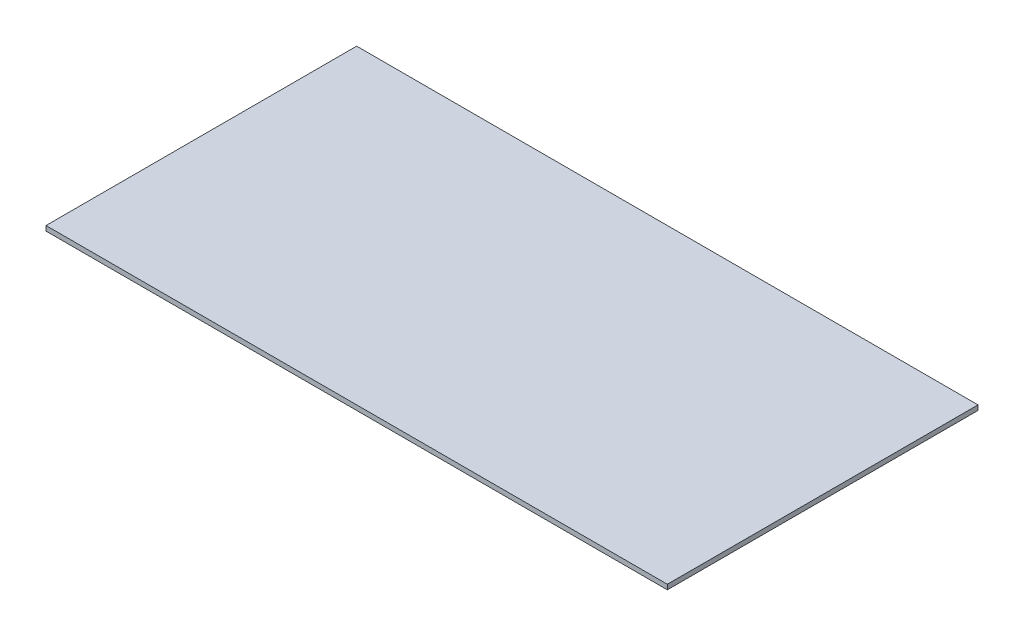
ISO-10303-21;
HEADER;
FILE_DESCRIPTION(('STEP AP214'),'2;1');
FILE_NAME('part.step','',(''),(''),'','','');
FILE_SCHEMA(('AUTOMOTIVE_DESIGN { 1 0 10303 214 1 1 1 1 }'));
ENDSEC;
DATA;
#1=APPLICATION_CONTEXT('core data for automotive mechanical design processes');
#2=APPLICATION_PROTOCOL_DEFINITION('international standard','automotive_design',2000,#1);
#3=PRODUCT_CONTEXT('',#1,'mechanical');
#4=PRODUCT('Part','Part','',(#3));
#5=PRODUCT_RELATED_PRODUCT_CATEGORY('part','',(#4));
#6=PRODUCT_DEFINITION_FORMATION('','',#4);
#7=PRODUCT_DEFINITION_CONTEXT('part definition',#1,'design');
#8=PRODUCT_DEFINITION('design','',#6,#7);
#9=PRODUCT_DEFINITION_SHAPE('','',#8);
#10=(LENGTH_UNIT() NAMED_UNIT(*) SI_UNIT(.MILLI.,.METRE.));
#11=(NAMED_UNIT(*) PLANE_ANGLE_UNIT() SI_UNIT($,.RADIAN.));
#12=(NAMED_UNIT(*) SI_UNIT($,.STERADIAN.) SOLID_ANGLE_UNIT());
#13=UNCERTAINTY_MEASURE_WITH_UNIT(LENGTH_MEASURE(1.E-05),#10,'distance_accuracy_value','');
#14=(GEOMETRIC_REPRESENTATION_CONTEXT(3) GLOBAL_UNCERTAINTY_ASSIGNED_CONTEXT((#13)) GLOBAL_UNIT_ASSIGNED_CONTEXT((#10,
#11,#12)) REPRESENTATION_CONTEXT('',''));
#15=CARTESIAN_POINT('',(0.,0.,0.));
#16=DIRECTION('',(0.,0.,1.));
#17=DIRECTION('',(1.,0.,0.));
#18=AXIS2_PLACEMENT_3D('',#15,#16,#17);
#19=CARTESIAN_POINT('',(-1219.2,19.05,-609.6));
#20=DIRECTION('',(1.,0.,0.));
#21=DIRECTION('',(0.,0.,-1.));
#22=AXIS2_PLACEMENT_3D('',#19,#20,#21);
#23=PLANE('',#22);
#24=DIRECTION('',(0.,0.,1.));
#25=VECTOR('',#24,1.);
#26=CARTESIAN_POINT('',(-1219.2,0.,-609.6));
#27=LINE('',#26,#25);
#28=CARTESIAN_POINT('',(-1219.2,0.,-609.6));
#29=VERTEX_POINT('',#28);
#30=CARTESIAN_POINT('',(-1219.2,0.,609.6));
#31=VERTEX_POINT('',#30);
#32=EDGE_CURVE('E101',#29,#31,#27,.T.);
#33=ORIENTED_EDGE('',*,*,#32,.T.);
#34=DIRECTION('',(0.,-1.,0.));
#35=VECTOR('',#34,1.);
#36=CARTESIAN_POINT('',(-1219.2,19.05,609.6));
#37=LINE('',#36,#35);
#38=CARTESIAN_POINT('',(-1219.2,19.05,609.6));
#39=VERTEX_POINT('',#38);
#40=EDGE_CURVE('E11',#39,#31,#37,.T.);
#41=ORIENTED_EDGE('',*,*,#40,.F.);
#42=DIRECTION('',(0.,0.,1.));
#43=VECTOR('',#42,1.);
#44=CARTESIAN_POINT('',(-1219.2,19.05,-609.6));
#45=LINE('',#44,#43);
#46=CARTESIAN_POINT('',(-1219.2,19.05,-609.6));
#47=VERTEX_POINT('',#46);
#48=EDGE_CURVE('E84',#47,#39,#45,.T.);
#49=ORIENTED_EDGE('',*,*,#48,.F.);
#50=DIRECTION('',(0.,-1.,0.));
#51=VECTOR('',#50,1.);
#52=CARTESIAN_POINT('',(-1219.2,19.05,-609.6));
#53=LINE('',#52,#51);
#54=EDGE_CURVE('E97',#47,#29,#53,.T.);
#55=ORIENTED_EDGE('',*,*,#54,.T.);
#56=EDGE_LOOP('',(#33,#41,#49,#55));
#57=FACE_BOUND('',#56,.T.);
#58=ADVANCED_FACE('F32',(#57),#23,.F.);
#59=CARTESIAN_POINT('',(1219.2,19.05,609.599999999999));
#60=DIRECTION('',(0.,0.,-1.));
#61=DIRECTION('',(-1.,0.,0.));
#62=AXIS2_PLACEMENT_3D('',#59,#60,#61);
#63=PLANE('',#62);
#64=DIRECTION('',(1.,0.,0.));
#65=VECTOR('',#64,1.);
#66=CARTESIAN_POINT('',(1219.2,0.,609.599999999999));
#67=LINE('',#66,#65);
#68=CARTESIAN_POINT('',(1219.2,0.,609.599999999999));
#69=VERTEX_POINT('',#68);
#70=EDGE_CURVE('E89',#31,#69,#67,.T.);
#71=ORIENTED_EDGE('',*,*,#70,.T.);
#72=DIRECTION('',(0.,-1.,0.));
#73=VECTOR('',#72,1.);
#74=CARTESIAN_POINT('',(1219.2,19.05,609.599999999999));
#75=LINE('',#74,#73);
#76=CARTESIAN_POINT('',(1219.2,19.05,609.599999999999));
#77=VERTEX_POINT('',#76);
#78=EDGE_CURVE('E41',#77,#69,#75,.T.);
#79=ORIENTED_EDGE('',*,*,#78,.F.);
#80=DIRECTION('',(1.,0.,0.));
#81=VECTOR('',#80,1.);
#82=CARTESIAN_POINT('',(1219.2,19.05,609.599999999999));
#83=LINE('',#82,#81);
#84=EDGE_CURVE('E79',#39,#77,#83,.T.);
#85=ORIENTED_EDGE('',*,*,#84,.F.);
#86=ORIENTED_EDGE('',*,*,#40,.T.);
#87=EDGE_LOOP('',(#71,#79,#85,#86));
#88=FACE_BOUND('',#87,.T.);
#89=ADVANCED_FACE('F88',(#88),#63,.F.);
#90=CARTESIAN_POINT('',(1219.2,19.05,-609.6));
#91=DIRECTION('',(-1.,0.,0.));
#92=DIRECTION('',(0.,0.,1.));
#93=AXIS2_PLACEMENT_3D('',#90,#91,#92);
#94=PLANE('',#93);
#95=DIRECTION('',(0.,0.,-1.));
#96=VECTOR('',#95,1.);
#97=CARTESIAN_POINT('',(1219.2,0.,-609.6));
#98=LINE('',#97,#96);
#99=CARTESIAN_POINT('',(1219.2,0.,-609.6));
#100=VERTEX_POINT('',#99);
#101=EDGE_CURVE('E66',#69,#100,#98,.T.);
#102=ORIENTED_EDGE('',*,*,#101,.T.);
#103=DIRECTION('',(0.,-1.,0.));
#104=VECTOR('',#103,1.);
#105=CARTESIAN_POINT('',(1219.2,19.05,-609.6));
#106=LINE('',#105,#104);
#107=CARTESIAN_POINT('',(1219.2,19.05,-609.6));
#108=VERTEX_POINT('',#107);
#109=EDGE_CURVE('E91',#108,#100,#106,.T.);
#110=ORIENTED_EDGE('',*,*,#109,.F.);
#111=DIRECTION('',(0.,0.,-1.));
#112=VECTOR('',#111,1.);
#113=CARTESIAN_POINT('',(1219.2,19.05,-609.6));
#114=LINE('',#113,#112);
#115=EDGE_CURVE('E82',#77,#108,#114,.T.);
#116=ORIENTED_EDGE('',*,*,#115,.F.);
#117=ORIENTED_EDGE('',*,*,#78,.T.);
#118=EDGE_LOOP('',(#102,#110,#116,#117));
#119=FACE_BOUND('',#118,.T.);
#120=ADVANCED_FACE('F92',(#119),#94,.F.);
#121=CARTESIAN_POINT('',(1219.2,19.05,-609.6));
#122=DIRECTION('',(0.,0.,1.));
#123=DIRECTION('',(1.,0.,0.));
#124=AXIS2_PLACEMENT_3D('',#121,#122,#123);
#125=PLANE('',#124);
#126=DIRECTION('',(-1.,0.,0.));
#127=VECTOR('',#126,1.);
#128=CARTESIAN_POINT('',(1219.2,0.,-609.6));
#129=LINE('',#128,#127);
#130=EDGE_CURVE('E72',#100,#29,#129,.T.);
#131=ORIENTED_EDGE('',*,*,#130,.T.);
#132=ORIENTED_EDGE('',*,*,#54,.F.);
#133=DIRECTION('',(-1.,0.,0.));
#134=VECTOR('',#133,1.);
#135=CARTESIAN_POINT('',(1219.2,19.05,-609.6));
#136=LINE('',#135,#134);
#137=EDGE_CURVE('E49',#108,#47,#136,.T.);
#138=ORIENTED_EDGE('',*,*,#137,.F.);
#139=ORIENTED_EDGE('',*,*,#109,.T.);
#140=EDGE_LOOP('',(#131,#132,#138,#139));
#141=FACE_BOUND('',#140,.T.);
#142=ADVANCED_FACE('F115',(#141),#125,.F.);
#143=CARTESIAN_POINT('',(0.,19.05,0.));
#144=DIRECTION('',(0.,-1.,0.));
#145=DIRECTION('',(0.,0.,-1.));
#146=AXIS2_PLACEMENT_3D('',#143,#144,#145);
#147=PLANE('',#146);
#148=ORIENTED_EDGE('',*,*,#48,.T.);
#149=ORIENTED_EDGE('',*,*,#84,.T.);
#150=ORIENTED_EDGE('',*,*,#115,.T.);
#151=ORIENTED_EDGE('',*,*,#137,.T.);
#152=EDGE_LOOP('',(#148,#149,#150,#151));
#153=FACE_BOUND('',#152,.T.);
#154=ADVANCED_FACE('F80',(#153),#147,.F.);
#155=CARTESIAN_POINT('',(0.,0.,0.));
#156=DIRECTION('',(0.,-1.,0.));
#157=DIRECTION('',(0.,0.,-1.));
#158=AXIS2_PLACEMENT_3D('',#155,#156,#157);
#159=PLANE('',#158);
#160=ORIENTED_EDGE('',*,*,#32,.F.);
#161=ORIENTED_EDGE('',*,*,#130,.F.);
#162=ORIENTED_EDGE('',*,*,#101,.F.);
#163=ORIENTED_EDGE('',*,*,#70,.F.);
#164=EDGE_LOOP('',(#160,#161,#162,#163));
#165=FACE_BOUND('',#164,.T.);
#166=ADVANCED_FACE('F118',(#165),#159,.T.);
#167=CLOSED_SHELL('',(#58,#89,#120,#142,#154,#166));
#168=MANIFOLD_SOLID_BREP('B2',#167);
#169=ADVANCED_BREP_SHAPE_REPRESENTATION('',(#18,#168),#14);
#170=SHAPE_DEFINITION_REPRESENTATION(#9,#169);
ENDSEC;
END-ISO-10303-21;
